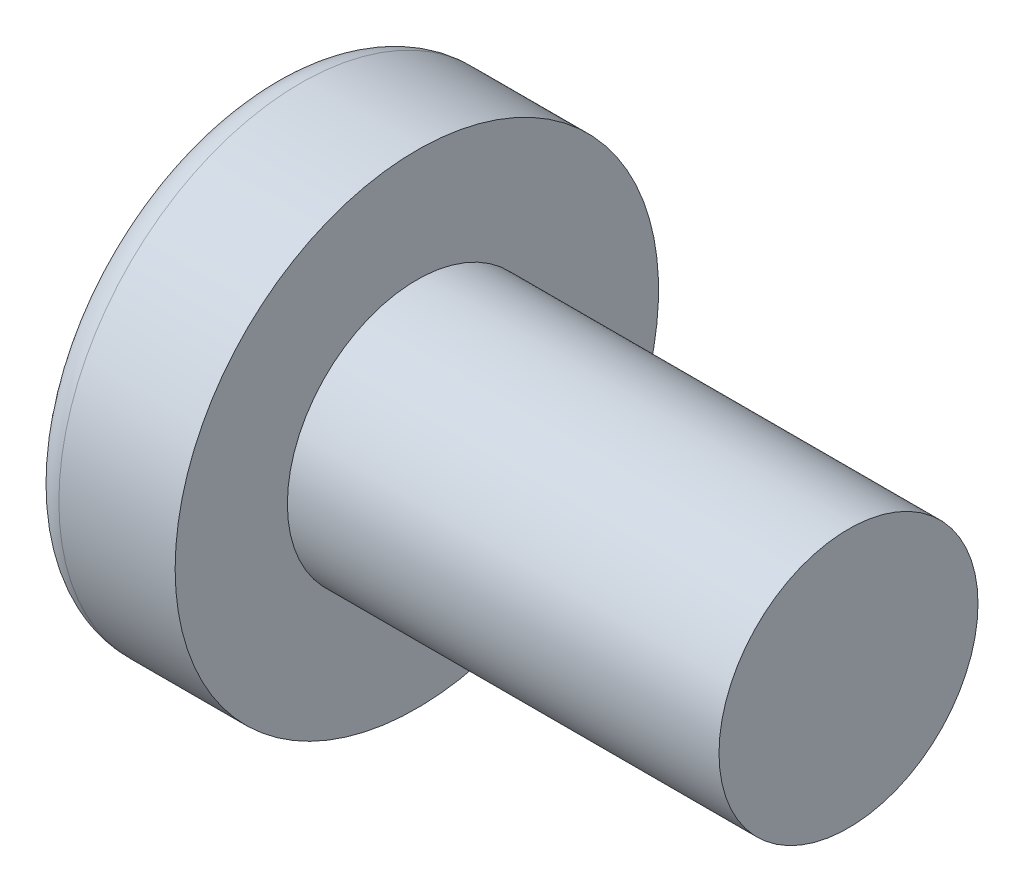
ISO-10303-21;
HEADER;
FILE_DESCRIPTION(('STEP AP214'),'2;1');
FILE_NAME('part.step','',(''),(''),'','','');
FILE_SCHEMA(('AUTOMOTIVE_DESIGN { 1 0 10303 214 1 1 1 1 }'));
ENDSEC;
DATA;
#1=APPLICATION_CONTEXT('core data for automotive mechanical design processes');
#2=APPLICATION_PROTOCOL_DEFINITION('international standard','automotive_design',2000,#1);
#3=PRODUCT_CONTEXT('',#1,'mechanical');
#4=PRODUCT('Part','Part','',(#3));
#5=PRODUCT_RELATED_PRODUCT_CATEGORY('part','',(#4));
#6=PRODUCT_DEFINITION_FORMATION('','',#4);
#7=PRODUCT_DEFINITION_CONTEXT('part definition',#1,'design');
#8=PRODUCT_DEFINITION('design','',#6,#7);
#9=PRODUCT_DEFINITION_SHAPE('','',#8);
#10=(LENGTH_UNIT() NAMED_UNIT(*) SI_UNIT(.MILLI.,.METRE.));
#11=(NAMED_UNIT(*) PLANE_ANGLE_UNIT() SI_UNIT($,.RADIAN.));
#12=(NAMED_UNIT(*) SI_UNIT($,.STERADIAN.) SOLID_ANGLE_UNIT());
#13=UNCERTAINTY_MEASURE_WITH_UNIT(LENGTH_MEASURE(1.E-05),#10,'distance_accuracy_value','');
#14=(GEOMETRIC_REPRESENTATION_CONTEXT(3) GLOBAL_UNCERTAINTY_ASSIGNED_CONTEXT((#13)) GLOBAL_UNIT_ASSIGNED_CONTEXT((#10,
#11,#12)) REPRESENTATION_CONTEXT('',''));
#15=CARTESIAN_POINT('',(0.,0.,0.));
#16=DIRECTION('',(0.,0.,1.));
#17=DIRECTION('',(1.,0.,0.));
#18=AXIS2_PLACEMENT_3D('',#15,#16,#17);
#19=CARTESIAN_POINT('',(5.,0.,0.));
#20=DIRECTION('',(-1.,0.,0.));
#21=DIRECTION('',(0.,1.,0.));
#22=AXIS2_PLACEMENT_3D('',#19,#20,#21);
#23=SPHERICAL_SURFACE('',#22,5.);
#24=CARTESIAN_POINT('',(0.747150706810473,0.,0.));
#25=DIRECTION('',(-1.,0.,0.));
#26=DIRECTION('',(0.,0.,1.));
#27=AXIS2_PLACEMENT_3D('',#24,#25,#26);
#28=CIRCLE('',#27,2.62931034482759);
#29=CARTESIAN_POINT('',(0.747150706810473,0.,2.62931034482759));
#30=VERTEX_POINT('',#29);
#31=EDGE_CURVE('E154',#30,#30,#28,.T.);
#32=ORIENTED_EDGE('',*,*,#31,.T.);
#33=EDGE_LOOP('',(#32));
#34=FACE_BOUND('',#33,.T.);
#35=CARTESIAN_POINT('',(4.98382636322272,-0.153868112043297,0.));
#36=DIRECTION('',(-0.104537710696287,-0.994520923380891,0.));
#37=DIRECTION('',(0.994520923380891,-0.104537710696287,0.));
#38=AXIS2_PLACEMENT_3D('',#35,#36,#37);
#39=CIRCLE('',#38,4.99760572850336);
#40=CARTESIAN_POINT('',(0.188596138461545,0.350175974082163,1.31444652548076));
#41=VERTEX_POINT('',#40);
#42=CARTESIAN_POINT('',(0.0270341343313624,0.367158343834486,0.367158343834487));
#43=VERTEX_POINT('',#42);
#44=EDGE_CURVE('E185',#41,#43,#39,.T.);
#45=ORIENTED_EDGE('',*,*,#44,.F.);
#46=CARTESIAN_POINT('',(3.98403090792016,0.,-1.41352221506761));
#47=DIRECTION('',(0.583636048152575,0.,0.812015371342713));
#48=DIRECTION('',(0.812015371342714,0.,-0.583636048152575));
#49=AXIS2_PLACEMENT_3D('',#46,#47,#48);
#50=CIRCLE('',#49,4.68719124331927);
#51=CARTESIAN_POINT('',(0.188596138461545,-0.350175974082172,1.31444652548076));
#52=VERTEX_POINT('',#51);
#53=EDGE_CURVE('E150',#41,#52,#50,.T.);
#54=ORIENTED_EDGE('',*,*,#53,.T.);
#55=CARTESIAN_POINT('',(4.98382636322272,0.153868112043297,0.));
#56=DIRECTION('',(-0.104537710696287,0.994520923380891,0.));
#57=DIRECTION('',(-0.994520923380891,-0.104537710696287,0.));
#58=AXIS2_PLACEMENT_3D('',#55,#56,#57);
#59=CIRCLE('',#58,4.99760572850336);
#60=CARTESIAN_POINT('',(0.0270341343313616,-0.367158343834489,0.367158343834487));
#61=VERTEX_POINT('',#60);
#62=EDGE_CURVE('E106',#61,#52,#59,.T.);
#63=ORIENTED_EDGE('',*,*,#62,.F.);
#64=CARTESIAN_POINT('',(4.98382636322272,0.,-0.153868112043297));
#65=DIRECTION('',(-0.104537710696287,0.,-0.994520923380891));
#66=DIRECTION('',(-0.994520923380891,0.,0.104537710696287));
#67=AXIS2_PLACEMENT_3D('',#64,#65,#66);
#68=CIRCLE('',#67,4.99760572850336);
#69=CARTESIAN_POINT('',(0.188596138461545,-1.31444652548077,0.350175974082167));
#70=VERTEX_POINT('',#69);
#71=EDGE_CURVE('E131',#70,#61,#68,.T.);
#72=ORIENTED_EDGE('',*,*,#71,.F.);
#73=CARTESIAN_POINT('',(3.98403090792016,1.41352221506761,0.));
#74=DIRECTION('',(0.583636048152575,-0.812015371342713,0.));
#75=DIRECTION('',(0.812015371342714,0.583636048152575,0.));
#76=AXIS2_PLACEMENT_3D('',#73,#74,#75);
#77=CIRCLE('',#76,4.68719124331927);
#78=CARTESIAN_POINT('',(0.188596138461545,-1.31444652548077,-0.350175974082167));
#79=VERTEX_POINT('',#78);
#80=EDGE_CURVE('E139',#70,#79,#77,.T.);
#81=ORIENTED_EDGE('',*,*,#80,.T.);
#82=CARTESIAN_POINT('',(4.98382636322272,0.,0.153868112043297));
#83=DIRECTION('',(-0.104537710696287,0.,0.994520923380891));
#84=DIRECTION('',(0.994520923380891,0.,0.104537710696287));
#85=AXIS2_PLACEMENT_3D('',#82,#83,#84);
#86=CIRCLE('',#85,4.99760572850336);
#87=CARTESIAN_POINT('',(0.0270341343313624,-0.367158343834486,-0.367158343834487));
#88=VERTEX_POINT('',#87);
#89=EDGE_CURVE('E49',#88,#79,#86,.T.);
#90=ORIENTED_EDGE('',*,*,#89,.F.);
#91=CARTESIAN_POINT('',(0.188596138461545,-0.350175974082162,-1.31444652548077));
#92=VERTEX_POINT('',#91);
#93=EDGE_CURVE('E192',#92,#88,#59,.T.);
#94=ORIENTED_EDGE('',*,*,#93,.F.);
#95=CARTESIAN_POINT('',(3.98403090792016,0.,1.41352221506761));
#96=DIRECTION('',(0.583636048152575,0.,-0.812015371342713));
#97=DIRECTION('',(-0.812015371342714,0.,-0.583636048152575));
#98=AXIS2_PLACEMENT_3D('',#95,#96,#97);
#99=CIRCLE('',#98,4.68719124331927);
#100=CARTESIAN_POINT('',(0.188596138461545,0.350175974082172,-1.31444652548076));
#101=VERTEX_POINT('',#100);
#102=EDGE_CURVE('E132',#92,#101,#99,.T.);
#103=ORIENTED_EDGE('',*,*,#102,.T.);
#104=CARTESIAN_POINT('',(0.0270341343313616,0.367158343834489,-0.367158343834487));
#105=VERTEX_POINT('',#104);
#106=EDGE_CURVE('E180',#105,#101,#39,.T.);
#107=ORIENTED_EDGE('',*,*,#106,.F.);
#108=CARTESIAN_POINT('',(0.188596138461545,1.31444652548076,-0.350175974082167));
#109=VERTEX_POINT('',#108);
#110=EDGE_CURVE('E42',#109,#105,#86,.T.);
#111=ORIENTED_EDGE('',*,*,#110,.F.);
#112=CARTESIAN_POINT('',(3.98403090792016,-1.41352221506761,0.));
#113=DIRECTION('',(0.583636048152575,0.812015371342713,0.));
#114=DIRECTION('',(-0.812015371342714,0.583636048152575,0.));
#115=AXIS2_PLACEMENT_3D('',#112,#113,#114);
#116=CIRCLE('',#115,4.68719124331927);
#117=CARTESIAN_POINT('',(0.188596138461545,1.31444652548076,0.350175974082167));
#118=VERTEX_POINT('',#117);
#119=EDGE_CURVE('E11',#109,#118,#116,.T.);
#120=ORIENTED_EDGE('',*,*,#119,.T.);
#121=EDGE_CURVE('E168',#43,#118,#68,.T.);
#122=ORIENTED_EDGE('',*,*,#121,.F.);
#123=EDGE_LOOP('',(#45,#54,#63,#72,#81,#90,#94,#103,#107,#111,#120,#122));
#124=FACE_BOUND('',#123,.T.);
#125=ADVANCED_FACE('F34',(#34,#124),#23,.T.);
#126=CARTESIAN_POINT('',(2.01739130434783,0.,-0.15794466403162));
#127=DIRECTION('',(-0.104537710696287,0.,0.994520923380891));
#128=DIRECTION('',(0.994520923380891,0.,0.104537710696287));
#129=AXIS2_PLACEMENT_3D('',#126,#127,#128);
#130=PLANE('',#129);
#131=ORIENTED_EDGE('',*,*,#110,.T.);
#132=DIRECTION('',(0.989130931836555,-0.103971149085093,0.103971149085092));
#133=VECTOR('',#132,1.);
#134=CARTESIAN_POINT('',(2.03363450411053,0.156237282238383,-0.156237282238382));
#135=LINE('',#134,#133);
#136=CARTESIAN_POINT('',(1.76,0.185000000000001,-0.184999999999999));
#137=VERTEX_POINT('',#136);
#138=EDGE_CURVE('E174',#105,#137,#135,.T.);
#139=ORIENTED_EDGE('',*,*,#138,.T.);
#140=DIRECTION('',(0.80907355338853,-0.581521616498006,0.0850446632823171));
#141=VECTOR('',#140,1.);
#142=CARTESIAN_POINT('',(0.,1.45,-0.37));
#143=LINE('',#142,#141);
#144=EDGE_CURVE('E155',#109,#137,#143,.T.);
#145=ORIENTED_EDGE('',*,*,#144,.F.);
#146=EDGE_LOOP('',(#131,#139,#145));
#147=FACE_BOUND('',#146,.T.);
#148=ADVANCED_FACE('F173',(#147),#130,.T.);
#149=DIRECTION('',(0.80907355338853,0.581521616498006,0.0850446632823171));
#150=VECTOR('',#149,1.);
#151=CARTESIAN_POINT('',(0.,-1.45,-0.37));
#152=LINE('',#151,#150);
#153=CARTESIAN_POINT('',(1.76,-0.185,-0.185));
#154=VERTEX_POINT('',#153);
#155=EDGE_CURVE('E140',#79,#154,#152,.T.);
#156=ORIENTED_EDGE('',*,*,#155,.T.);
#157=DIRECTION('',(-0.989130931836555,-0.103971149085092,-0.103971149085092));
#158=VECTOR('',#157,1.);
#159=CARTESIAN_POINT('',(2.03363450411053,-0.156237282238382,-0.156237282238382));
#160=LINE('',#159,#158);
#161=EDGE_CURVE('E195',#154,#88,#160,.T.);
#162=ORIENTED_EDGE('',*,*,#161,.T.);
#163=ORIENTED_EDGE('',*,*,#89,.T.);
#164=EDGE_LOOP('',(#156,#162,#163));
#165=FACE_BOUND('',#164,.T.);
#166=ADVANCED_FACE('F210',(#165),#130,.T.);
#167=CARTESIAN_POINT('',(2.01739130434783,0.,0.15794466403162));
#168=DIRECTION('',(-0.104537710696287,0.,-0.994520923380891));
#169=DIRECTION('',(-0.994520923380891,0.,0.104537710696287));
#170=AXIS2_PLACEMENT_3D('',#167,#168,#169);
#171=PLANE('',#170);
#172=DIRECTION('',(0.80907355338853,-0.581521616498006,-0.0850446632823171));
#173=VECTOR('',#172,1.);
#174=CARTESIAN_POINT('',(0.,1.45,0.37));
#175=LINE('',#174,#173);
#176=CARTESIAN_POINT('',(1.76,0.185,0.185));
#177=VERTEX_POINT('',#176);
#178=EDGE_CURVE('E211',#118,#177,#175,.T.);
#179=ORIENTED_EDGE('',*,*,#178,.T.);
#180=DIRECTION('',(-0.989130931836555,0.103971149085092,0.103971149085092));
#181=VECTOR('',#180,1.);
#182=CARTESIAN_POINT('',(2.03363450411053,0.156237282238382,0.156237282238382));
#183=LINE('',#182,#181);
#184=EDGE_CURVE('E189',#177,#43,#183,.T.);
#185=ORIENTED_EDGE('',*,*,#184,.T.);
#186=ORIENTED_EDGE('',*,*,#121,.T.);
#187=EDGE_LOOP('',(#179,#185,#186));
#188=FACE_BOUND('',#187,.T.);
#189=ADVANCED_FACE('F215',(#188),#171,.T.);
#190=ORIENTED_EDGE('',*,*,#71,.T.);
#191=DIRECTION('',(0.989130931836555,0.103971149085093,-0.103971149085092));
#192=VECTOR('',#191,1.);
#193=CARTESIAN_POINT('',(2.03363450411053,-0.156237282238383,0.156237282238382));
#194=LINE('',#193,#192);
#195=CARTESIAN_POINT('',(1.76,-0.185000000000001,0.184999999999999));
#196=VERTEX_POINT('',#195);
#197=EDGE_CURVE('E104',#61,#196,#194,.T.);
#198=ORIENTED_EDGE('',*,*,#197,.T.);
#199=DIRECTION('',(0.80907355338853,0.581521616498006,-0.085044663282317));
#200=VECTOR('',#199,1.);
#201=CARTESIAN_POINT('',(0.,-1.45,0.37));
#202=LINE('',#201,#200);
#203=EDGE_CURVE('E129',#70,#196,#202,.T.);
#204=ORIENTED_EDGE('',*,*,#203,.F.);
#205=EDGE_LOOP('',(#190,#198,#204));
#206=FACE_BOUND('',#205,.T.);
#207=ADVANCED_FACE('F128',(#206),#171,.T.);
#208=CARTESIAN_POINT('',(-25.4,0.,0.));
#209=DIRECTION('',(-1.,0.,0.));
#210=DIRECTION('',(0.,0.,1.));
#211=AXIS2_PLACEMENT_3D('',#208,#209,#210);
#212=CYLINDRICAL_SURFACE('',#211,1.5);
#213=CARTESIAN_POINT('',(7.4,0.,0.));
#214=DIRECTION('',(-1.,0.,0.));
#215=DIRECTION('',(0.,0.,1.));
#216=AXIS2_PLACEMENT_3D('',#213,#214,#215);
#217=CIRCLE('',#216,1.5);
#218=CARTESIAN_POINT('',(7.4,0.,1.5));
#219=VERTEX_POINT('',#218);
#220=EDGE_CURVE('E151',#219,#219,#217,.T.);
#221=ORIENTED_EDGE('',*,*,#220,.T.);
#222=EDGE_LOOP('',(#221));
#223=FACE_BOUND('',#222,.T.);
#224=CARTESIAN_POINT('',(2.4,0.,0.));
#225=DIRECTION('',(-1.,0.,0.));
#226=DIRECTION('',(0.,0.,1.));
#227=AXIS2_PLACEMENT_3D('',#224,#225,#226);
#228=CIRCLE('',#227,1.5);
#229=CARTESIAN_POINT('',(2.4,0.,1.5));
#230=VERTEX_POINT('',#229);
#231=EDGE_CURVE('E164',#230,#230,#228,.T.);
#232=ORIENTED_EDGE('',*,*,#231,.F.);
#233=EDGE_LOOP('',(#232));
#234=FACE_BOUND('',#233,.T.);
#235=ADVANCED_FACE('F36',(#223,#234),#212,.T.);
#236=CARTESIAN_POINT('',(2.4,1.5,0.));
#237=DIRECTION('',(-1.,0.,0.));
#238=DIRECTION('',(0.,0.,1.));
#239=AXIS2_PLACEMENT_3D('',#236,#237,#238);
#240=PLANE('',#239);
#241=CARTESIAN_POINT('',(2.4,0.,0.));
#242=DIRECTION('',(-1.,0.,0.));
#243=DIRECTION('',(0.,0.,1.));
#244=AXIS2_PLACEMENT_3D('',#241,#242,#243);
#245=CIRCLE('',#244,2.8);
#246=CARTESIAN_POINT('',(2.4,0.,2.8));
#247=VERTEX_POINT('',#246);
#248=EDGE_CURVE('E161',#247,#247,#245,.T.);
#249=ORIENTED_EDGE('',*,*,#248,.F.);
#250=EDGE_LOOP('',(#249));
#251=FACE_BOUND('',#250,.T.);
#252=ORIENTED_EDGE('',*,*,#231,.T.);
#253=EDGE_LOOP('',(#252));
#254=FACE_BOUND('',#253,.T.);
#255=ADVANCED_FACE('F243',(#251,#254),#240,.F.);
#256=CARTESIAN_POINT('',(-25.4,0.,0.));
#257=DIRECTION('',(-1.,0.,0.));
#258=DIRECTION('',(0.,0.,1.));
#259=AXIS2_PLACEMENT_3D('',#256,#257,#258);
#260=CYLINDRICAL_SURFACE('',#259,2.8);
#261=ORIENTED_EDGE('',*,*,#248,.T.);
#262=EDGE_LOOP('',(#261));
#263=FACE_BOUND('',#262,.T.);
#264=CARTESIAN_POINT('',(1.05335585592012,0.,0.));
#265=DIRECTION('',(-1.,0.,0.));
#266=DIRECTION('',(0.,0.,1.));
#267=AXIS2_PLACEMENT_3D('',#264,#265,#266);
#268=CIRCLE('',#267,2.8);
#269=CARTESIAN_POINT('',(1.05335585592012,0.,2.8));
#270=VERTEX_POINT('',#269);
#271=EDGE_CURVE('E158',#270,#270,#268,.T.);
#272=ORIENTED_EDGE('',*,*,#271,.F.);
#273=EDGE_LOOP('',(#272));
#274=FACE_BOUND('',#273,.T.);
#275=ADVANCED_FACE('F240',(#263,#274),#260,.T.);
#276=CARTESIAN_POINT('',(1.05335585592012,0.,0.));
#277=DIRECTION('',(-1.,0.,0.));
#278=DIRECTION('',(0.,0.,1.));
#279=AXIS2_PLACEMENT_3D('',#276,#277,#278);
#280=TOROIDAL_SURFACE('',#279,2.44,0.360000000000001);
#281=ORIENTED_EDGE('',*,*,#271,.T.);
#282=EDGE_LOOP('',(#281));
#283=FACE_BOUND('',#282,.T.);
#284=ORIENTED_EDGE('',*,*,#31,.F.);
#285=EDGE_LOOP('',(#284));
#286=FACE_BOUND('',#285,.T.);
#287=ADVANCED_FACE('F237',(#283,#286),#280,.T.);
#288=CARTESIAN_POINT('',(7.4,1.5,0.));
#289=DIRECTION('',(1.,0.,0.));
#290=DIRECTION('',(0.,0.,-1.));
#291=AXIS2_PLACEMENT_3D('',#288,#289,#290);
#292=PLANE('',#291);
#293=ORIENTED_EDGE('',*,*,#220,.F.);
#294=EDGE_LOOP('',(#293));
#295=FACE_BOUND('',#294,.T.);
#296=ADVANCED_FACE('F235',(#295),#292,.T.);
#297=CARTESIAN_POINT('',(1.76,0.185,0.185));
#298=DIRECTION('',(0.583636048152575,0.812015371342713,0.));
#299=DIRECTION('',(-0.812015371342714,0.583636048152575,0.));
#300=AXIS2_PLACEMENT_3D('',#297,#298,#299);
#301=PLANE('',#300);
#302=ORIENTED_EDGE('',*,*,#144,.T.);
#303=DIRECTION('',(0.,0.,-1.));
#304=VECTOR('',#303,1.);
#305=CARTESIAN_POINT('',(1.76,0.185,0.185));
#306=LINE('',#305,#304);
#307=EDGE_CURVE('E122',#177,#137,#306,.T.);
#308=ORIENTED_EDGE('',*,*,#307,.F.);
#309=ORIENTED_EDGE('',*,*,#178,.F.);
#310=ORIENTED_EDGE('',*,*,#119,.F.);
#311=EDGE_LOOP('',(#302,#308,#309,#310));
#312=FACE_BOUND('',#311,.T.);
#313=ADVANCED_FACE('F214',(#312),#301,.F.);
#314=CARTESIAN_POINT('',(1.76,-0.185,-0.185));
#315=DIRECTION('',(0.583636048152575,-0.812015371342713,0.));
#316=DIRECTION('',(0.812015371342714,0.583636048152575,0.));
#317=AXIS2_PLACEMENT_3D('',#314,#315,#316);
#318=PLANE('',#317);
#319=ORIENTED_EDGE('',*,*,#203,.T.);
#320=DIRECTION('',(0.,0.,1.));
#321=VECTOR('',#320,1.);
#322=CARTESIAN_POINT('',(1.76,-0.185,-0.185));
#323=LINE('',#322,#321);
#324=EDGE_CURVE('E121',#154,#196,#323,.T.);
#325=ORIENTED_EDGE('',*,*,#324,.F.);
#326=ORIENTED_EDGE('',*,*,#155,.F.);
#327=ORIENTED_EDGE('',*,*,#80,.F.);
#328=EDGE_LOOP('',(#319,#325,#326,#327));
#329=FACE_BOUND('',#328,.T.);
#330=ADVANCED_FACE('F136',(#329),#318,.F.);
#331=CARTESIAN_POINT('',(1.76,0.185,-0.185));
#332=DIRECTION('',(-1.,0.,0.));
#333=DIRECTION('',(0.,0.,1.));
#334=AXIS2_PLACEMENT_3D('',#331,#332,#333);
#335=PLANE('',#334);
#336=DIRECTION('',(0.,1.,0.));
#337=VECTOR('',#336,1.);
#338=CARTESIAN_POINT('',(1.76,-0.185,-0.185));
#339=LINE('',#338,#337);
#340=EDGE_CURVE('E144',#154,#137,#339,.T.);
#341=ORIENTED_EDGE('',*,*,#340,.F.);
#342=ORIENTED_EDGE('',*,*,#324,.T.);
#343=DIRECTION('',(0.,-1.,0.));
#344=VECTOR('',#343,1.);
#345=CARTESIAN_POINT('',(1.76,0.185,0.185));
#346=LINE('',#345,#344);
#347=EDGE_CURVE('E113',#177,#196,#346,.T.);
#348=ORIENTED_EDGE('',*,*,#347,.F.);
#349=ORIENTED_EDGE('',*,*,#307,.T.);
#350=EDGE_LOOP('',(#341,#342,#348,#349));
#351=FACE_BOUND('',#350,.T.);
#352=ADVANCED_FACE('F142',(#351),#335,.T.);
#353=CARTESIAN_POINT('',(1.76,0.185000000000001,-0.184999999999999));
#354=DIRECTION('',(0.583636048152575,0.,-0.812015371342713));
#355=DIRECTION('',(0.812015371342714,0.,0.583636048152575));
#356=AXIS2_PLACEMENT_3D('',#353,#354,#355);
#357=PLANE('',#356);
#358=DIRECTION('',(0.80907355338853,0.085044663282315,0.581521616498006));
#359=VECTOR('',#358,1.);
#360=CARTESIAN_POINT('',(0.,-0.369999999999995,-1.45));
#361=LINE('',#360,#359);
#362=EDGE_CURVE('E200',#92,#154,#361,.T.);
#363=ORIENTED_EDGE('',*,*,#362,.T.);
#364=ORIENTED_EDGE('',*,*,#340,.T.);
#365=DIRECTION('',(0.80907355338853,-0.0850446632823191,0.581521616498006));
#366=VECTOR('',#365,1.);
#367=CARTESIAN_POINT('',(0.,0.370000000000005,-1.45));
#368=LINE('',#367,#366);
#369=EDGE_CURVE('E110',#101,#137,#368,.T.);
#370=ORIENTED_EDGE('',*,*,#369,.F.);
#371=ORIENTED_EDGE('',*,*,#102,.F.);
#372=EDGE_LOOP('',(#363,#364,#370,#371));
#373=FACE_BOUND('',#372,.T.);
#374=ADVANCED_FACE('F205',(#373),#357,.F.);
#375=CARTESIAN_POINT('',(2.01739130434783,-0.15794466403162,0.));
#376=DIRECTION('',(-0.104537710696287,0.994520923380891,0.));
#377=DIRECTION('',(-0.994520923380891,-0.104537710696287,0.));
#378=AXIS2_PLACEMENT_3D('',#375,#376,#377);
#379=PLANE('',#378);
#380=ORIENTED_EDGE('',*,*,#93,.T.);
#381=ORIENTED_EDGE('',*,*,#161,.F.);
#382=ORIENTED_EDGE('',*,*,#362,.F.);
#383=EDGE_LOOP('',(#380,#381,#382));
#384=FACE_BOUND('',#383,.T.);
#385=ADVANCED_FACE('F209',(#384),#379,.T.);
#386=CARTESIAN_POINT('',(2.01739130434783,0.15794466403162,0.));
#387=DIRECTION('',(-0.104537710696287,-0.994520923380891,0.));
#388=DIRECTION('',(0.994520923380891,-0.104537710696287,0.));
#389=AXIS2_PLACEMENT_3D('',#386,#387,#388);
#390=PLANE('',#389);
#391=ORIENTED_EDGE('',*,*,#106,.T.);
#392=ORIENTED_EDGE('',*,*,#369,.T.);
#393=ORIENTED_EDGE('',*,*,#138,.F.);
#394=EDGE_LOOP('',(#391,#392,#393));
#395=FACE_BOUND('',#394,.T.);
#396=ADVANCED_FACE('F203',(#395),#390,.T.);
#397=CARTESIAN_POINT('',(1.76,-0.185000000000001,0.184999999999999));
#398=DIRECTION('',(0.583636048152575,0.,0.812015371342713));
#399=DIRECTION('',(-0.812015371342714,0.,0.583636048152575));
#400=AXIS2_PLACEMENT_3D('',#397,#398,#399);
#401=PLANE('',#400);
#402=DIRECTION('',(0.80907355338853,-0.0850446632823151,-0.581521616498006));
#403=VECTOR('',#402,1.);
#404=CARTESIAN_POINT('',(0.,0.369999999999995,1.45));
#405=LINE('',#404,#403);
#406=EDGE_CURVE('E109',#41,#177,#405,.T.);
#407=ORIENTED_EDGE('',*,*,#406,.T.);
#408=ORIENTED_EDGE('',*,*,#347,.T.);
#409=DIRECTION('',(0.80907355338853,0.0850446632823192,-0.581521616498006));
#410=VECTOR('',#409,1.);
#411=CARTESIAN_POINT('',(0.,-0.370000000000005,1.45));
#412=LINE('',#411,#410);
#413=EDGE_CURVE('E100',#52,#196,#412,.T.);
#414=ORIENTED_EDGE('',*,*,#413,.F.);
#415=ORIENTED_EDGE('',*,*,#53,.F.);
#416=EDGE_LOOP('',(#407,#408,#414,#415));
#417=FACE_BOUND('',#416,.T.);
#418=ADVANCED_FACE('F114',(#417),#401,.F.);
#419=ORIENTED_EDGE('',*,*,#44,.T.);
#420=ORIENTED_EDGE('',*,*,#184,.F.);
#421=ORIENTED_EDGE('',*,*,#406,.F.);
#422=EDGE_LOOP('',(#419,#420,#421));
#423=FACE_BOUND('',#422,.T.);
#424=ADVANCED_FACE('F216',(#423),#390,.T.);
#425=ORIENTED_EDGE('',*,*,#62,.T.);
#426=ORIENTED_EDGE('',*,*,#413,.T.);
#427=ORIENTED_EDGE('',*,*,#197,.F.);
#428=EDGE_LOOP('',(#425,#426,#427));
#429=FACE_BOUND('',#428,.T.);
#430=ADVANCED_FACE('F102',(#429),#379,.T.);
#431=CLOSED_SHELL('',(#125,#148,#166,#189,#207,#235,#255,#275,#287,#296,#313,#330,#352,#374,
#385,#396,#418,#424,#430));
#432=MANIFOLD_SOLID_BREP('B2',#431);
#433=ADVANCED_BREP_SHAPE_REPRESENTATION('',(#18,#432),#14);
#434=SHAPE_DEFINITION_REPRESENTATION(#9,#433);
ENDSEC;
END-ISO-10303-21;
